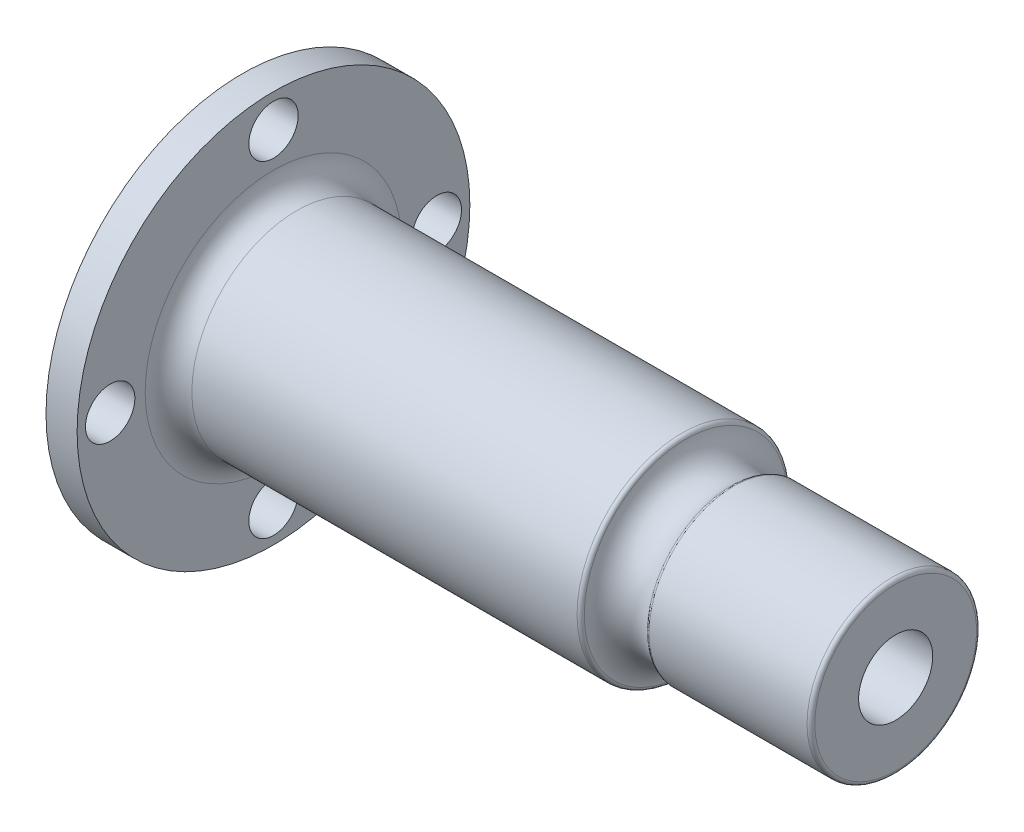
ISO-10303-21;
HEADER;
FILE_DESCRIPTION(('STEP AP214'),'2;1');
FILE_NAME('part.step','',(''),(''),'','','');
FILE_SCHEMA(('AUTOMOTIVE_DESIGN { 1 0 10303 214 1 1 1 1 }'));
ENDSEC;
DATA;
#1=APPLICATION_CONTEXT('core data for automotive mechanical design processes');
#2=APPLICATION_PROTOCOL_DEFINITION('international standard','automotive_design',2000,#1);
#3=PRODUCT_CONTEXT('',#1,'mechanical');
#4=PRODUCT('Part','Part','',(#3));
#5=PRODUCT_RELATED_PRODUCT_CATEGORY('part','',(#4));
#6=PRODUCT_DEFINITION_FORMATION('','',#4);
#7=PRODUCT_DEFINITION_CONTEXT('part definition',#1,'design');
#8=PRODUCT_DEFINITION('design','',#6,#7);
#9=PRODUCT_DEFINITION_SHAPE('','',#8);
#10=(LENGTH_UNIT() NAMED_UNIT(*) SI_UNIT(.MILLI.,.METRE.));
#11=(NAMED_UNIT(*) PLANE_ANGLE_UNIT() SI_UNIT($,.RADIAN.));
#12=(NAMED_UNIT(*) SI_UNIT($,.STERADIAN.) SOLID_ANGLE_UNIT());
#13=UNCERTAINTY_MEASURE_WITH_UNIT(LENGTH_MEASURE(1.E-05),#10,'distance_accuracy_value','');
#14=(GEOMETRIC_REPRESENTATION_CONTEXT(3) GLOBAL_UNCERTAINTY_ASSIGNED_CONTEXT((#13)) GLOBAL_UNIT_ASSIGNED_CONTEXT((#10,
#11,#12)) REPRESENTATION_CONTEXT('',''));
#15=CARTESIAN_POINT('',(0.,0.,0.));
#16=DIRECTION('',(0.,0.,1.));
#17=DIRECTION('',(1.,0.,0.));
#18=AXIS2_PLACEMENT_3D('',#15,#16,#17);
#19=CARTESIAN_POINT('',(54.5999999999995,13.5000000000002,1.38777878078145E-13));
#20=DIRECTION('',(-1.,0.,0.));
#21=DIRECTION('',(0.,0.,1.));
#22=AXIS2_PLACEMENT_3D('',#19,#20,#21);
#23=PLANE('',#22);
#24=CARTESIAN_POINT('',(54.5999999999995,-21.0000000000002,-1.30451205393456E-12));
#25=DIRECTION('',(-1.,0.,0.));
#26=DIRECTION('',(0.,0.,1.));
#27=AXIS2_PLACEMENT_3D('',#24,#25,#26);
#28=CIRCLE('',#27,3.17500000000128);
#29=CARTESIAN_POINT('',(54.5999999999995,-21.0000000000002,3.17499999999998));
#30=VERTEX_POINT('',#29);
#31=EDGE_CURVE('E177',#30,#30,#28,.F.);
#32=ORIENTED_EDGE('',*,*,#31,.F.);
#33=EDGE_LOOP('',(#32));
#34=FACE_BOUND('',#33,.T.);
#35=CARTESIAN_POINT('',(54.5999999999995,3.33066907387547E-13,-21.0000000000006));
#36=DIRECTION('',(-1.,0.,0.));
#37=DIRECTION('',(0.,0.,1.));
#38=AXIS2_PLACEMENT_3D('',#35,#36,#37);
#39=CIRCLE('',#38,3.17500000000047);
#40=CARTESIAN_POINT('',(54.5999999999995,3.31656924146273E-13,-17.8250000000002));
#41=VERTEX_POINT('',#40);
#42=EDGE_CURVE('E71',#41,#41,#39,.F.);
#43=ORIENTED_EDGE('',*,*,#42,.F.);
#44=EDGE_LOOP('',(#43));
#45=FACE_BOUND('',#44,.T.);
#46=CARTESIAN_POINT('',(54.5999999999998,-2.22044604925031E-13,0.));
#47=DIRECTION('',(-1.,0.,0.));
#48=DIRECTION('',(0.,0.,1.));
#49=AXIS2_PLACEMENT_3D('',#46,#47,#48);
#50=CIRCLE('',#49,16.5);
#51=CARTESIAN_POINT('',(54.5999999999998,-2.29372076887557E-13,16.5000000000001));
#52=VERTEX_POINT('',#51);
#53=EDGE_CURVE('E50',#52,#52,#50,.T.);
#54=ORIENTED_EDGE('',*,*,#53,.T.);
#55=EDGE_LOOP('',(#54));
#56=FACE_BOUND('',#55,.T.);
#57=CARTESIAN_POINT('',(54.5999999999998,-2.22044604925031E-13,0.));
#58=DIRECTION('',(-1.,0.,0.));
#59=DIRECTION('',(0.,0.,1.));
#60=AXIS2_PLACEMENT_3D('',#57,#58,#59);
#61=CIRCLE('',#60,25.25);
#62=CARTESIAN_POINT('',(54.5999999999998,-2.33257857473745E-13,25.2500000000001));
#63=VERTEX_POINT('',#62);
#64=EDGE_CURVE('E59',#63,#63,#61,.T.);
#65=ORIENTED_EDGE('',*,*,#64,.F.);
#66=EDGE_LOOP('',(#65));
#67=FACE_BOUND('',#66,.T.);
#68=CARTESIAN_POINT('',(54.5999999999995,21.,0.));
#69=DIRECTION('',(-1.,0.,0.));
#70=DIRECTION('',(0.,0.,1.));
#71=AXIS2_PLACEMENT_3D('',#68,#69,#70);
#72=CIRCLE('',#71,3.175);
#73=CARTESIAN_POINT('',(54.5999999999995,21.,3.17499999999996));
#74=VERTEX_POINT('',#73);
#75=EDGE_CURVE('E72',#74,#74,#72,.F.);
#76=ORIENTED_EDGE('',*,*,#75,.F.);
#77=EDGE_LOOP('',(#76));
#78=FACE_BOUND('',#77,.T.);
#79=CARTESIAN_POINT('',(54.6000000000002,-9.99200722162641E-13,20.9999999999994));
#80=DIRECTION('',(-1.,0.,0.));
#81=DIRECTION('',(0.,0.,1.));
#82=AXIS2_PLACEMENT_3D('',#79,#80,#81);
#83=CIRCLE('',#82,3.17500000000095);
#84=CARTESIAN_POINT('',(54.6000000000002,-1.00061070540392E-12,24.1750000000004));
#85=VERTEX_POINT('',#84);
#86=EDGE_CURVE('E181',#85,#85,#83,.F.);
#87=ORIENTED_EDGE('',*,*,#86,.F.);
#88=EDGE_LOOP('',(#87));
#89=FACE_BOUND('',#88,.T.);
#90=ADVANCED_FACE('F37',(#34,#45,#56,#67,#78,#89),#23,.F.);
#91=CARTESIAN_POINT('',(43.0851485148516,-4.44089209850063E-13,1.38777878078145E-13));
#92=DIRECTION('',(1.,0.,0.));
#93=DIRECTION('',(0.,0.,-1.));
#94=AXIS2_PLACEMENT_3D('',#91,#92,#93);
#95=CONICAL_SURFACE('',#94,8.,1.15994513549311);
#96=CARTESIAN_POINT('',(49.7656543388043,-23.2245749399343,-2.2653678148683));
#97=CARTESIAN_POINT('',(49.7132868239322,-23.0910039417577,-2.39651970513222));
#98=CARTESIAN_POINT('',(49.6562570449438,-22.9465767832423,-2.51506317578598));
#99=CARTESIAN_POINT('',(49.5345438672557,-22.6413248056925,-2.72416030299259));
#100=CARTESIAN_POINT('',(49.4698443412618,-22.4804655363798,-2.81465348107135));
#101=CARTESIAN_POINT('',(49.3347647398545,-22.1482429657563,-2.96569184746934));
#102=CARTESIAN_POINT('',(49.2644045474879,-21.9769168990074,-3.02633695585924));
#103=CARTESIAN_POINT('',(49.1195294787827,-21.6282433206149,-3.11743718212168));
#104=CARTESIAN_POINT('',(49.0450159822175,-21.4508978162613,-3.14790226373299));
#105=CARTESIAN_POINT('',(48.8894385753592,-21.0851626406207,-3.17943753753823));
#106=CARTESIAN_POINT('',(48.808237219161,-20.896688170984,-3.17885428188936));
#107=CARTESIAN_POINT('',(48.6450781806765,-20.5230577401005,-3.14457874222476));
#108=CARTESIAN_POINT('',(48.5631202330724,-20.3379030155998,-3.11087436983991));
#109=CARTESIAN_POINT('',(48.3977754750071,-19.9694259119053,-3.00937129219942));
#110=CARTESIAN_POINT('',(48.3144398375621,-19.7863971707155,-2.94041481366924));
#111=CARTESIAN_POINT('',(48.1520142125055,-19.4345555309157,-2.76917327301335));
#112=CARTESIAN_POINT('',(48.072924583895,-19.265743833676,-2.66688539786275));
#113=CARTESIAN_POINT('',(47.9235218697905,-18.9509523029699,-2.43302934228595));
#114=CARTESIAN_POINT('',(47.8530667321534,-18.8045886299866,-2.30207678750244));
#115=CARTESIAN_POINT('',(47.7552632066986,-18.6036532760828,-2.08516371171527));
#116=CARTESIAN_POINT('',(47.7239631827298,-18.5397524822966,-2.00940743344191));
#117=CARTESIAN_POINT('',(47.6644211441453,-18.4188288606008,-1.85149892979986));
#118=CARTESIAN_POINT('',(47.6361773643199,-18.361802060253,-1.76935044405753));
#119=CARTESIAN_POINT('',(47.5853810801288,-18.2597156870073,-1.60622298543487));
#120=CARTESIAN_POINT('',(47.5625515022665,-18.2140575078825,-1.52570399757321));
#121=CARTESIAN_POINT('',(47.5202045432026,-18.1296782620913,-1.36032700781497));
#122=CARTESIAN_POINT('',(47.5006853583875,-18.0909534172665,-1.27547140166355));
#123=CARTESIAN_POINT('',(47.4652849681862,-18.0209339635354,-1.10205458017123));
#124=CARTESIAN_POINT('',(47.4494019530298,-17.9896356580571,-1.01349523430301));
#125=CARTESIAN_POINT('',(47.4215546137079,-17.9348883481429,-0.833418798706617));
#126=CARTESIAN_POINT('',(47.4095898539978,-17.9114384712866,-0.741902038961416));
#127=CARTESIAN_POINT('',(47.382085868266,-17.8576088545977,-0.484122683348831));
#128=CARTESIAN_POINT('',(47.3710704356722,-17.836154620863,-0.315383876957203));
#129=CARTESIAN_POINT('',(47.3630657893119,-17.8205547800152,0.0235545540213407));
#130=CARTESIAN_POINT('',(47.3660709721932,-17.8263982633446,0.193753567894406));
#131=CARTESIAN_POINT('',(47.3852668290221,-17.8638526602665,0.520156654483197));
#132=CARTESIAN_POINT('',(47.4006596686708,-17.8939045297782,0.676589644057801));
#133=CARTESIAN_POINT('',(47.4427303697854,-17.9764713372809,0.981785461524499));
#134=CARTESIAN_POINT('',(47.4694089889671,-18.0289877835236,1.13054777366256));
#135=CARTESIAN_POINT('',(47.5334938755365,-18.1560347590003,1.42063902099703));
#136=CARTESIAN_POINT('',(47.5711615551353,-18.2311032435568,1.56167326679909));
#137=CARTESIAN_POINT('',(47.655169410089,-18.4000089061259,1.82912947974794));
#138=CARTESIAN_POINT('',(47.7015123372687,-18.4938520401866,1.95554678970183));
#139=CARTESIAN_POINT('',(47.8054437954769,-18.7064192886613,2.20201133667734));
#140=CARTESIAN_POINT('',(47.8636614476122,-18.8266018507851,2.32053382024481));
#141=CARTESIAN_POINT('',(47.9860778569756,-19.0823033949481,2.53595088953874));
#142=CARTESIAN_POINT('',(48.0502791209527,-19.2178288098077,2.63283635249441));
#143=CARTESIAN_POINT('',(48.1893447229636,-19.514997374556,2.81219303454492));
#144=CARTESIAN_POINT('',(48.2646335521793,-19.6778971320029,2.8922570304973));
#145=CARTESIAN_POINT('',(48.4178100864735,-20.013850695337,3.02335552665692));
#146=CARTESIAN_POINT('',(48.4956987428656,-20.1869082360656,3.07437927457101));
#147=CARTESIAN_POINT('',(48.6573097276308,-20.5507990634283,3.14890450269277));
#148=CARTESIAN_POINT('',(48.7410718896963,-20.7420448393239,3.17032269121466));
#149=CARTESIAN_POINT('',(48.9069727619869,-21.1260038825151,3.17830620509222));
#150=CARTESIAN_POINT('',(48.9891112081087,-21.3187173815937,3.16486590682535));
#151=CARTESIAN_POINT('',(49.1504745429829,-21.7021098404763,3.10254310810231));
#152=CARTESIAN_POINT('',(49.2296592351936,-21.8927454707262,3.05328579805663));
#153=CARTESIAN_POINT('',(49.3820022197921,-22.2637442059926,2.91932270102298));
#154=CARTESIAN_POINT('',(49.4551615912651,-22.4441091486112,2.83462327801926));
#155=CARTESIAN_POINT('',(49.5903627483608,-22.7807699282867,2.63554367455254));
#156=CARTESIAN_POINT('',(49.6527447029991,-22.937762589415,2.52257652833133));
#157=CARTESIAN_POINT('',(49.7681239642305,-23.2304568995811,2.26787713858251));
#158=CARTESIAN_POINT('',(49.8211254878949,-23.3661681127742,2.12615788268518));
#159=CARTESIAN_POINT('',(49.9125970727456,-23.6018411792385,1.82878538249345));
#160=CARTESIAN_POINT('',(49.9518321433682,-23.7036581900974,1.67483807818983));
#161=CARTESIAN_POINT('',(50.0194055822717,-23.8797434868103,1.3497487954954));
#162=CARTESIAN_POINT('',(50.0477490063003,-23.9540245538913,1.1786148415485));
#163=CARTESIAN_POINT('',(50.0910284630923,-24.0677222365502,0.836632754469789));
#164=CARTESIAN_POINT('',(50.1067444735226,-24.1091644355148,0.666554909900648));
#165=CARTESIAN_POINT('',(50.1273464479991,-24.1635288824121,0.321280378398514));
#166=CARTESIAN_POINT('',(50.1322360006341,-24.1764605805639,0.146085407127175));
#167=CARTESIAN_POINT('',(50.1310545515307,-24.1733391479366,-0.196983969213794));
#168=CARTESIAN_POINT('',(50.1254129630454,-24.1584215842309,-0.364871633759527));
#169=CARTESIAN_POINT('',(50.1041785188764,-24.1023997353117,-0.695607692969382));
#170=CARTESIAN_POINT('',(50.0885833875716,-24.0612894618145,-0.858454926339915));
#171=CARTESIAN_POINT('',(50.0479196119823,-23.9544830392759,-1.17451856232095));
#172=CARTESIAN_POINT('',(50.0228536580787,-23.8887938724237,-1.3277376855903));
#173=CARTESIAN_POINT('',(49.9639731071274,-23.7352458462273,-1.62059698684357));
#174=CARTESIAN_POINT('',(49.9301691398169,-23.6474139265853,-1.76025338178828));
#175=CARTESIAN_POINT('',(49.8732737771231,-23.5004830353357,-1.95835528430707));
#176=CARTESIAN_POINT('',(49.8530692005323,-23.4484436233123,-2.0230138055953));
#177=CARTESIAN_POINT('',(49.8107609251313,-23.3398257045486,-2.14771476910424));
#178=CARTESIAN_POINT('',(49.7886574276274,-23.2832476789931,-2.20775769935256));
#179=CARTESIAN_POINT('',(49.7656543388043,-23.2245749399343,-2.2653678148683));
#180=B_SPLINE_CURVE_WITH_KNOTS('',3,(#96,#97,#98,#99,#100,#101,#102,#103,#104,#105,#106,#107,
#108,#109,#110,#111,#112,#113,#114,#115,#116,#117,#118,#119,#120,#121,#122,#123,#124,#125,#126,
#127,#128,#129,#130,#131,#132,#133,#134,#135,#136,#137,#138,#139,#140,#141,#142,#143,#144,#145,
#146,#147,#148,#149,#150,#151,#152,#153,#154,#155,#156,#157,#158,#159,#160,#161,#162,#163,#164,
#165,#166,#167,#168,#169,#170,#171,#172,#173,#174,#175,#176,#177,#178,#179),.UNSPECIFIED.,.T.,
.F.,(4,2,2,2,2,2,2,2,2,2,2,2,2,2,2,2,2,2,2,2,2,2,2,2,2,2,2,2,2,2,2,2,2,2,2,2,2,2,2,2,2,4),(0.,
0.582812467227126,1.16687291781942,1.74896462547257,2.33086409524148,2.94378152154864,
3.55692273031369,4.19163517971926,4.82640120997384,5.44867937309624,5.76009284999615,
6.07132549130354,6.35694821173589,6.64241481186573,6.92773902105781,7.21303150346497,
7.72146582759417,8.22969697287253,8.7075886047151,9.18551232681305,9.67588909186943,
10.166421670868,10.6998670618904,11.2335369454979,11.8205255432419,12.4077313352217,
13.0344550818411,13.6612799423449,14.294760421582,14.9281272018692,15.5345997035514,
16.1407988627439,16.703918377843,17.2667761841978,17.7913988312298,18.3158475583161,
18.8193771641034,19.3230219302043,19.8265237331336,20.3294158885059,20.5854506959361,
20.841458394288),.UNSPECIFIED.);
#181=CARTESIAN_POINT('',(49.7656543388043,-23.2245749399343,-2.2653678148683));
#182=VERTEX_POINT('',#181);
#183=EDGE_CURVE('E180',#182,#182,#180,.T.);
#184=ORIENTED_EDGE('',*,*,#183,.T.);
#185=EDGE_LOOP('',(#184));
#186=FACE_BOUND('',#185,.T.);
#187=CARTESIAN_POINT('',(49.7656543388052,-2.26536781486608,-23.2245749399339));
#188=CARTESIAN_POINT('',(49.8131090064027,-2.14650064352539,-23.3456156487838));
#189=CARTESIAN_POINT('',(49.8568039434094,-2.01712003021576,-23.4579158499019));
#190=CARTESIAN_POINT('',(49.935503202155,-1.74012355214171,-23.6612267221608));
#191=CARTESIAN_POINT('',(49.9705034030418,-1.59249909018831,-23.7522272972117));
#192=CARTESIAN_POINT('',(50.030837862143,-1.28245185141723,-23.9096767243973));
#193=CARTESIAN_POINT('',(50.0561532164281,-1.12000089204495,-23.9760775521867));
#194=CARTESIAN_POINT('',(50.0962128178245,-0.785189755270953,-24.0813764183063));
#195=CARTESIAN_POINT('',(50.1109597449096,-0.612832102022387,-24.1202814290742));
#196=CARTESIAN_POINT('',(50.129073854644,-0.269692747264765,-24.1680958292623));
#197=CARTESIAN_POINT('',(50.1328267307554,-0.0990726201662459,-24.1780218169082));
#198=CARTESIAN_POINT('',(50.1299354955042,0.241448873479098,-24.1703818410567));
#199=CARTESIAN_POINT('',(50.1232926518637,0.411350325132562,-24.1528192296986));
#200=CARTESIAN_POINT('',(50.100040594404,0.742368147962944,-24.0914936332751));
#201=CARTESIAN_POINT('',(50.0836172215779,0.903588694994377,-24.0482192352757));
#202=CARTESIAN_POINT('',(50.0414466354625,1.21619412573754,-23.9375155394649));
#203=CARTESIAN_POINT('',(50.0156990070748,1.36757857121039,-23.8700851662758));
#204=CARTESIAN_POINT('',(49.9549901207202,1.65964760323631,-23.7118869471512));
#205=CARTESIAN_POINT('',(49.9198540182209,1.80005585326233,-23.6206771271991));
#206=CARTESIAN_POINT('',(49.8415631450506,2.06348368809359,-23.4187238510361));
#207=CARTESIAN_POINT('',(49.7984067951542,2.18649983989645,-23.3079765480184));
#208=CARTESIAN_POINT('',(49.7027231302881,2.4185157398059,-23.0642542410418));
#209=CARTESIAN_POINT('',(49.6498281164592,2.52646977835131,-22.9304292163987));
#210=CARTESIAN_POINT('',(49.5376210437677,2.7184998526028,-22.6490670588577));
#211=CARTESIAN_POINT('',(49.4783071482487,2.80256902897337,-22.5015260030564));
#212=CARTESIAN_POINT('',(49.3503513200638,2.95050499883802,-22.1863671247792));
#213=CARTESIAN_POINT('',(49.281349180983,3.01260506931777,-22.0180663131484));
#214=CARTESIAN_POINT('',(49.1391228159335,3.10749617483234,-21.6751143560643));
#215=CARTESIAN_POINT('',(49.0658972550709,3.14027788859584,-21.5004612093476));
#216=CARTESIAN_POINT('',(48.9119980275175,3.17757224105816,-21.1378173098295));
#217=CARTESIAN_POINT('',(48.8311493965243,3.18011228268851,-20.9496965462195));
#218=CARTESIAN_POINT('',(48.6685108509017,3.15217265365362,-20.5763124211268));
#219=CARTESIAN_POINT('',(48.5867206809275,3.12168380639222,-20.3910498682644));
#220=CARTESIAN_POINT('',(48.4213468537295,3.02670075934084,-20.0215265659494));
#221=CARTESIAN_POINT('',(48.3378084017329,2.96099313680585,-19.8375551026953));
#222=CARTESIAN_POINT('',(48.1747018604258,2.79614685709504,-19.4832959469048));
#223=CARTESIAN_POINT('',(48.0951342009762,2.69700458940268,-19.3130097346617));
#224=CARTESIAN_POINT('',(47.9442353528268,2.46886216594759,-18.9942495137512));
#225=CARTESIAN_POINT('',(47.8727890675993,2.34038673078858,-18.8454594892672));
#226=CARTESIAN_POINT('',(47.7732880546115,2.12685292026664,-18.6405724077839));
#227=CARTESIAN_POINT('',(47.7413863302246,2.05216608020453,-18.5753008016506));
#228=CARTESIAN_POINT('',(47.6805713219282,1.89626978435965,-18.4515357941468));
#229=CARTESIAN_POINT('',(47.6516563261009,1.81506411298069,-18.3930385075509));
#230=CARTESIAN_POINT('',(47.5994382287379,1.65338797707884,-18.2879011105777));
#231=CARTESIAN_POINT('',(47.5758715335664,1.57337469746518,-18.2406875725874));
#232=CARTESIAN_POINT('',(47.5320183554242,1.4088482554447,-18.1531688096482));
#233=CARTESIAN_POINT('',(47.5117300889334,1.32433757319248,-18.1128598277841));
#234=CARTESIAN_POINT('',(47.474769896538,1.15144026414308,-18.0396600216787));
#235=CARTESIAN_POINT('',(47.458096155209,1.06305561002216,-18.006765473147));
#236=CARTESIAN_POINT('',(47.428658874923,0.883151462482185,-17.9488339753208));
#237=CARTESIAN_POINT('',(47.4158948907695,0.791632327300932,-17.9237961313904));
#238=CARTESIAN_POINT('',(47.3861841314093,0.533671005379914,-17.8656068014557));
#239=CARTESIAN_POINT('',(47.3737609509049,0.364557843803981,-17.8414001560515));
#240=CARTESIAN_POINT('',(47.36304824126,0.0243245367819597,-17.8205188667806));
#241=CARTESIAN_POINT('',(47.3647526518751,-0.146794716667068,-17.8238324177097));
#242=CARTESIAN_POINT('',(47.3815801843668,-0.474800998404434,-17.856655420661));
#243=CARTESIAN_POINT('',(47.395846129637,-0.631902755834756,-17.8844915547083));
#244=CARTESIAN_POINT('',(47.4357942678068,-0.938796069218159,-17.9628338071871));
#245=CARTESIAN_POINT('',(47.4614770397051,-1.08858725399163,-18.0133410753748));
#246=CARTESIAN_POINT('',(47.523590021058,-1.38047986746198,-18.1363409919505));
#247=CARTESIAN_POINT('',(47.5602459131584,-1.52233713796337,-18.2092963039183));
#248=CARTESIAN_POINT('',(47.6423503470224,-1.79175935050629,-18.3741305654306));
#249=CARTESIAN_POINT('',(47.6878016123737,-1.91931984601584,-18.4660153772819));
#250=CARTESIAN_POINT('',(47.7899179129914,-2.16822997166063,-18.6744977014759));
#251=CARTESIAN_POINT('',(47.8472098933581,-2.28811258186622,-18.7925375681776));
#252=CARTESIAN_POINT('',(47.967914391128,-2.50659697306376,-19.0441392028841));
#253=CARTESIAN_POINT('',(48.0313294805208,-2.60518975457032,-19.1777074983981));
#254=CARTESIAN_POINT('',(48.1689315804877,-2.78851745219439,-19.4710698245208));
#255=CARTESIAN_POINT('',(48.2435607377947,-2.870865154299,-19.6321504923653));
#256=CARTESIAN_POINT('',(48.3955961466111,-3.00686710135785,-19.9647757368748));
#257=CARTESIAN_POINT('',(48.4730033322315,-3.06051159656011,-20.1363238470498));
#258=CARTESIAN_POINT('',(48.6339810663154,-3.14087445075096,-20.4978564246838));
#259=CARTESIAN_POINT('',(48.7176061021436,-3.16546254918651,-20.6882936336685));
#260=CARTESIAN_POINT('',(48.8834671532225,-3.17998057625212,-21.071182878596));
#261=CARTESIAN_POINT('',(48.965702582461,-3.16989623246441,-21.2636357117367));
#262=CARTESIAN_POINT('',(49.1277380021873,-3.11437055382043,-21.647681062734));
#263=CARTESIAN_POINT('',(49.2074882122534,-3.06843941463676,-21.8392243869399));
#264=CARTESIAN_POINT('',(49.361081179566,-2.94098428301677,-22.2124400708859));
#265=CARTESIAN_POINT('',(49.4349317121023,-2.8595080831747,-22.3941253178957));
#266=CARTESIAN_POINT('',(49.5524157173794,-2.69375471038081,-22.6860923325043));
#267=CARTESIAN_POINT('',(49.5982036861729,-2.61856321910055,-22.8007433394923));
#268=CARTESIAN_POINT('',(49.6853863647254,-2.45305372085488,-23.020408531122));
#269=CARTESIAN_POINT('',(49.7267817597341,-2.36273807896936,-23.1254242185445));
#270=CARTESIAN_POINT('',(49.7656543388052,-2.26536781486608,-23.2245749399339));
#271=B_SPLINE_CURVE_WITH_KNOTS('',3,(#187,#188,#189,#190,#191,#192,#193,#194,#195,#196,#197,
#198,#199,#200,#201,#202,#203,#204,#205,#206,#207,#208,#209,#210,#211,#212,#213,#214,#215,#216,
#217,#218,#219,#220,#221,#222,#223,#224,#225,#226,#227,#228,#229,#230,#231,#232,#233,#234,#235,
#236,#237,#238,#239,#240,#241,#242,#243,#244,#245,#246,#247,#248,#249,#250,#251,#252,#253,#254,
#255,#256,#257,#258,#259,#260,#261,#262,#263,#264,#265,#266,#267,#268,#269,#270),.UNSPECIFIED.,
.T.,.F.,(4,2,2,2,2,2,2,2,2,2,2,2,2,2,2,2,2,2,2,2,2,2,2,2,2,2,2,2,2,2,2,2,2,2,2,2,2,2,2,2,2,4),
(0.,0.527997371553111,1.05624451096853,1.58551754245094,2.11465631174231,2.62499542681762,
3.13527231265566,3.63614957036098,4.1370491289322,4.64802000719318,5.15909160489778,
5.69643731719329,6.23393719062095,6.8080588155936,7.38236290792019,7.99393681413056,
8.60568068084004,9.24000057698888,9.87438899356659,10.4982128858706,10.8104095431168,
11.1224262523658,11.4095763757966,11.6965697549865,11.9834186537538,12.2702348774333,
12.7811423355361,13.2918306434866,13.7701570687709,14.2485077549049,14.7374652314376,
15.2265743622327,15.7575632334651,16.2887761230536,16.8733551903563,17.4581326984997,
18.0835484636424,18.7092217031074,19.3435969832029,19.977121921619,20.4096995312852,
20.8422095585207),.UNSPECIFIED.);
#272=CARTESIAN_POINT('',(49.7656543388052,-2.26536781486608,-23.2245749399339));
#273=VERTEX_POINT('',#272);
#274=EDGE_CURVE('E64',#273,#273,#271,.T.);
#275=ORIENTED_EDGE('',*,*,#274,.T.);
#276=EDGE_LOOP('',(#275));
#277=FACE_BOUND('',#276,.T.);
#278=CARTESIAN_POINT('',(50.6,-3.88578058618805E-13,0.));
#279=DIRECTION('',(-1.,0.,0.));
#280=DIRECTION('',(0.,0.,1.));
#281=AXIS2_PLACEMENT_3D('',#278,#279,#280);
#282=CIRCLE('',#281,25.25);
#283=CARTESIAN_POINT('',(50.6,-3.99791311167519E-13,25.25));
#284=VERTEX_POINT('',#283);
#285=EDGE_CURVE('E164',#284,#284,#282,.T.);
#286=ORIENTED_EDGE('',*,*,#285,.T.);
#287=EDGE_LOOP('',(#286));
#288=FACE_BOUND('',#287,.T.);
#289=CARTESIAN_POINT('',(43.0851485148516,-4.44089209850063E-13,1.38777878078145E-13));
#290=DIRECTION('',(-1.,0.,0.));
#291=DIRECTION('',(0.,0.,1.));
#292=AXIS2_PLACEMENT_3D('',#289,#290,#291);
#293=CIRCLE('',#292,8.);
#294=CARTESIAN_POINT('',(43.0851485148516,-4.47641923528863E-13,8.00000000000015));
#295=VERTEX_POINT('',#294);
#296=EDGE_CURVE('E63',#295,#295,#293,.T.);
#297=ORIENTED_EDGE('',*,*,#296,.F.);
#298=EDGE_LOOP('',(#297));
#299=FACE_BOUND('',#298,.T.);
#300=CARTESIAN_POINT('',(47.8238659812642,18.7447545904964,-2.23483748834798));
#301=CARTESIAN_POINT('',(47.8893001815065,18.8797767883707,-2.37108225606689));
#302=CARTESIAN_POINT('',(47.9594711010155,19.0262048425172,-2.49408613693269));
#303=CARTESIAN_POINT('',(48.1061988456842,19.3366596977608,-2.71107920209641));
#304=CARTESIAN_POINT('',(48.1827706522582,19.500728058412,-2.80499775173992));
#305=CARTESIAN_POINT('',(48.3392864561704,19.8408638967908,-2.96174892102481));
#306=CARTESIAN_POINT('',(48.419219062519,20.0168919195615,-3.02467859909215));
#307=CARTESIAN_POINT('',(48.5802951286452,20.3765804975569,-3.11873813105096));
#308=CARTESIAN_POINT('',(48.6614380239439,20.5602375617971,-3.14988236645002));
#309=CARTESIAN_POINT('',(48.826367689091,20.9385640202587,-3.18031218298327));
#310=CARTESIAN_POINT('',(48.9101176142232,21.1333668119546,-3.17816629540682));
#311=CARTESIAN_POINT('',(49.07446967776,21.5206808196784,-3.13806056054948));
#312=CARTESIAN_POINT('',(49.1550712258367,21.7131916012896,-3.10009403006634));
#313=CARTESIAN_POINT('',(49.3102283917251,22.0882081604987,-2.98903252625849));
#314=CARTESIAN_POINT('',(49.3848324983698,22.2707892482936,-2.91626150448925));
#315=CARTESIAN_POINT('',(49.5266913026511,22.6215927121648,-2.73675774335131));
#316=CARTESIAN_POINT('',(49.5939482576345,22.7898194949761,-2.63003547484771));
#317=CARTESIAN_POINT('',(49.7155510095594,23.0966543283229,-2.39171158437693));
#318=CARTESIAN_POINT('',(49.7704068712652,23.2363893715333,-2.261823982347));
#319=CARTESIAN_POINT('',(49.8700030693479,23.4917879431486,-1.97690688081218));
#320=CARTESIAN_POINT('',(49.9147483626375,23.607463265102,-1.82188976586766));
#321=CARTESIAN_POINT('',(49.9897245005436,23.8022379141033,-1.50344217903229));
#322=CARTESIAN_POINT('',(50.0207803372776,23.8834004364937,-1.34146715825175));
#323=CARTESIAN_POINT('',(50.0718789975789,24.0173333231728,-1.00455951047513));
#324=CARTESIAN_POINT('',(50.0919264041189,24.0701155024282,-0.829632310136094));
#325=CARTESIAN_POINT('',(50.1194576364075,24.1426904493666,-0.483250561834289));
#326=CARTESIAN_POINT('',(50.127628332135,24.1642862789767,-0.312226460776903));
#327=CARTESIAN_POINT('',(50.1333838519572,24.17949320787,0.0312249849457146));
#328=CARTESIAN_POINT('',(50.1309708491847,24.1731100520304,0.203652034289181));
#329=CARTESIAN_POINT('',(50.1158490449035,24.1331830461308,0.54011410795233));
#330=CARTESIAN_POINT('',(50.1034195372869,24.1003759963539,0.704250057126283));
#331=CARTESIAN_POINT('',(50.0689936711982,24.0097987820107,1.02440959067189));
#332=CARTESIAN_POINT('',(50.0469972146043,23.9520283614118,1.1804330918212));
#333=CARTESIAN_POINT('',(49.9937365973674,23.8127730902365,1.48219127702221));
#334=CARTESIAN_POINT('',(49.9623605124686,23.7310020751338,1.62777376115851));
#335=CARTESIAN_POINT('',(49.8913036397115,23.5468868684913,1.90300353345606));
#336=CARTESIAN_POINT('',(49.8516214273833,23.4445391482425,2.03264808225958));
#337=CARTESIAN_POINT('',(49.7629461662851,23.2174109479389,2.27882238452617));
#338=CARTESIAN_POINT('',(49.7136088844998,23.0918153538573,2.3944749625884));
#339=CARTESIAN_POINT('',(49.6081527484911,22.8256045578216,2.60315660131149));
#340=CARTESIAN_POINT('',(49.5520320476395,22.6849852672301,2.69617948070604));
#341=CARTESIAN_POINT('',(49.4303652517207,22.3829746577489,2.86351861689322));
#342=CARTESIAN_POINT('',(49.3644412223353,22.220824573967,2.93619008876876));
#343=CARTESIAN_POINT('',(49.2278507288792,21.8885182637104,3.05323165379557));
#344=CARTESIAN_POINT('',(49.1571827692853,21.7183595176067,3.09759277536638));
#345=CARTESIAN_POINT('',(49.0077666535753,21.3627724614898,3.15970621780728));
#346=CARTESIAN_POINT('',(48.9287949759241,21.177088270586,3.17546232075692));
#347=CARTESIAN_POINT('',(48.7691194087998,20.8065349707106,3.17451656248056));
#348=CARTESIAN_POINT('',(48.6884150190703,20.6216661162237,3.15780519938396));
#349=CARTESIAN_POINT('',(48.5236656950164,20.2493091309891,3.09102430328034));
#350=CARTESIAN_POINT('',(48.439633220382,20.0620751944702,3.03949272597292));
#351=CARTESIAN_POINT('',(48.2743894982023,19.698996339877,2.90270378193779));
#352=CARTESIAN_POINT('',(48.1931787204474,19.5231533141268,2.81744082819442));
#353=CARTESIAN_POINT('',(48.0366760242005,19.1887980003628,2.61498377282849));
#354=CARTESIAN_POINT('',(47.9613620928889,19.0302203003212,2.4979165145077));
#355=CARTESIAN_POINT('',(47.8551175006777,18.8092053952636,2.30018735208902));
#356=CARTESIAN_POINT('',(47.8208077739993,18.7383102463972,2.23054806496343));
#357=CARTESIAN_POINT('',(47.7548590620381,18.6028259851534,2.08425070284813));
#358=CARTESIAN_POINT('',(47.7232186065118,18.5382333981924,2.0075965408287));
#359=CARTESIAN_POINT('',(47.6651026815574,18.4202196783226,1.8531482445865));
#360=CARTESIAN_POINT('',(47.6384226007762,18.3663383968952,1.77578208196039));
#361=CARTESIAN_POINT('',(47.5881750591807,18.2653099691587,1.61586954194416));
#362=CARTESIAN_POINT('',(47.5646059292001,18.2181592105033,1.533325977827));
#363=CARTESIAN_POINT('',(47.520954654693,18.1311652976925,1.36363216758121));
#364=CARTESIAN_POINT('',(47.5008708328393,18.0913186278745,1.27648416385829));
#365=CARTESIAN_POINT('',(47.4645372980804,18.0194567935972,1.0982861112947));
#366=CARTESIAN_POINT('',(47.4482871167436,17.9874406723079,1.00723654079358));
#367=CARTESIAN_POINT('',(47.4088463765682,17.9099105583197,0.749416107370185));
#368=CARTESIAN_POINT('',(47.3901628356309,17.8734139516202,0.579099426608733));
#369=CARTESIAN_POINT('',(47.3673338168506,17.8288553145948,0.23397350380328));
#370=CARTESIAN_POINT('',(47.3631793521895,17.8207757071943,0.0591671062659827));
#371=CARTESIAN_POINT('',(47.3693974526022,17.8328947086084,-0.275463154047332));
#372=CARTESIAN_POINT('',(47.3786598486626,17.8509322245624,-0.435390058846768));
#373=CARTESIAN_POINT('',(47.4091795521889,17.9106167477196,-0.749611534756852));
#374=CARTESIAN_POINT('',(47.4304400378872,17.9522700106263,-0.903904601957972));
#375=CARTESIAN_POINT('',(47.483898118083,18.057660273098,-1.2035976442482));
#376=CARTESIAN_POINT('',(47.5161522496478,18.1215114646338,-1.34894696896929));
#377=CARTESIAN_POINT('',(47.5899588977516,18.268795236526,-1.62659350921269));
#378=CARTESIAN_POINT('',(47.6315020935212,18.3522081924181,-1.75890361804274));
#379=CARTESIAN_POINT('',(47.6995507673243,18.4901121735376,-1.94605854858177));
#380=CARTESIAN_POINT('',(47.723249068537,18.5383337990245,-2.00668191074506));
#381=CARTESIAN_POINT('',(47.7723350261039,18.6386819437388,-2.12385350901266));
#382=CARTESIAN_POINT('',(47.797722438279,18.6908078986899,-2.18040233168418));
#383=CARTESIAN_POINT('',(47.8238659812642,18.7447545904964,-2.23483748834798));
#384=B_SPLINE_CURVE_WITH_KNOTS('',3,(#300,#301,#302,#303,#304,#305,#306,#307,#308,#309,#310,
#311,#312,#313,#314,#315,#316,#317,#318,#319,#320,#321,#322,#323,#324,#325,#326,#327,#328,#329,
#330,#331,#332,#333,#334,#335,#336,#337,#338,#339,#340,#341,#342,#343,#344,#345,#346,#347,#348,
#349,#350,#351,#352,#353,#354,#355,#356,#357,#358,#359,#360,#361,#362,#363,#364,#365,#366,#367,
#368,#369,#370,#371,#372,#373,#374,#375,#376,#377,#378,#379,#380,#381,#382,#383),.UNSPECIFIED.,
.T.,.F.,(4,2,2,2,2,2,2,2,2,2,2,2,2,2,2,2,2,2,2,2,2,2,2,2,2,2,2,2,2,2,2,2,2,2,2,2,2,2,2,2,2,4),
(0.,0.607697233517729,1.21685891098312,1.82410033774145,2.43106689263205,3.06420261220487,
3.69745648183436,4.32492761048004,4.95220540877463,5.54459271955684,6.13668896714084,
6.68527319721517,7.23362887006116,7.74880081031213,8.26386697614408,8.76504867303852,
9.2662355103403,9.77365929866654,10.2811701796817,10.8120177841098,11.3430102263194,
11.9091327874435,12.4754346644453,13.0799272312278,13.6845967343739,14.316377041728,
14.948262036339,15.5776630055336,15.892687714973,16.2075377591756,16.5010870223551,
16.7944781371733,17.0877276616682,17.3809413355049,17.903400756044,18.4255369572033,
18.9068586309171,19.3883078641549,19.872271371015,20.3557514245209,20.5985854583647,
20.8413844638939),.UNSPECIFIED.);
#385=CARTESIAN_POINT('',(47.8238659812642,18.7447545904964,-2.23483748834798));
#386=VERTEX_POINT('',#385);
#387=EDGE_CURVE('E73',#386,#386,#384,.T.);
#388=ORIENTED_EDGE('',*,*,#387,.T.);
#389=EDGE_LOOP('',(#388));
#390=FACE_BOUND('',#389,.T.);
#391=CARTESIAN_POINT('',(47.8238659812646,-2.23483748834946,18.7447545904957));
#392=CARTESIAN_POINT('',(47.7667895719262,-2.11598467286963,18.6269801416909));
#393=CARTESIAN_POINT('',(47.7132422150005,-1.98691396757903,18.5177256489472));
#394=CARTESIAN_POINT('',(47.6154333208014,-1.71058824149063,18.3198158853773));
#395=CARTESIAN_POINT('',(47.5711737129144,-1.56332945247251,18.2311648941996));
#396=CARTESIAN_POINT('',(47.4940616479986,-1.25327158740701,18.0776789035777));
#397=CARTESIAN_POINT('',(47.4612553160196,-1.0904129649438,18.0129401450504));
#398=CARTESIAN_POINT('',(47.4093530686541,-0.754247840316152,17.9108993439297));
#399=CARTESIAN_POINT('',(47.3902500534609,-0.580946798986406,17.8735830932529));
#400=CARTESIAN_POINT('',(47.3678504762963,-0.241286847879735,17.8298647864532));
#401=CARTESIAN_POINT('',(47.3635861319518,-0.0752340422024369,17.8215697446005));
#402=CARTESIAN_POINT('',(47.3684264089622,0.255912617316729,17.8310012279594));
#403=CARTESIAN_POINT('',(47.3775283416744,0.421006657309524,17.8487225199544));
#404=CARTESIAN_POINT('',(47.4079053145887,0.738971772568723,17.9081221420054));
#405=CARTESIAN_POINT('',(47.4286984260854,0.8920687299225,17.9488523057304));
#406=CARTESIAN_POINT('',(47.4809367765676,1.18889747364049,18.0518077586616));
#407=CARTESIAN_POINT('',(47.5123834531678,1.33262799295487,18.1140359488795));
#408=CARTESIAN_POINT('',(47.5860025288257,1.6136812172783,18.2608587972504));
#409=CARTESIAN_POINT('',(47.6285865924702,1.75044224571432,18.34631840843));
#410=CARTESIAN_POINT('',(47.7218347224798,2.00777489155036,18.5352537111147));
#411=CARTESIAN_POINT('',(47.7725016562541,2.12834073562266,18.6387357973165));
#412=CARTESIAN_POINT('',(47.8851904039534,2.36201020832784,18.8713343732418));
#413=CARTESIAN_POINT('',(47.947833511385,2.47331946618809,19.001951684031));
#414=CARTESIAN_POINT('',(48.0783934730309,2.67259348834232,19.2775537400721));
#415=CARTESIAN_POINT('',(48.1463125448968,2.76054836668531,19.4225445340939));
#416=CARTESIAN_POINT('',(48.2921348205336,2.91915618798063,19.7377876343415));
#417=CARTESIAN_POINT('',(48.3703711136097,2.98734378159364,19.9091292754127));
#418=CARTESIAN_POINT('',(48.5285271912483,3.09307620082712,20.2602989961818));
#419=CARTESIAN_POINT('',(48.6084475331518,3.13061071298861,20.44012991065));
#420=CARTESIAN_POINT('',(48.7723278819263,3.17542016679094,20.8138304801388));
#421=CARTESIAN_POINT('',(48.856267022385,3.18090800111973,21.0079267135013));
#422=CARTESIAN_POINT('',(49.0214745742204,3.15629296298832,21.3950421949344));
#423=CARTESIAN_POINT('',(49.102742745794,3.12618690378304,21.5880613450183));
#424=CARTESIAN_POINT('',(49.2602081348827,3.03055313651474,21.9666259100677));
#425=CARTESIAN_POINT('',(49.3364197336946,2.96513118671377,22.1521918710232));
#426=CARTESIAN_POINT('',(49.4818991894992,2.79975522330881,22.5102477425625));
#427=CARTESIAN_POINT('',(49.551168829633,2.69981010695451,22.6827410082651));
#428=CARTESIAN_POINT('',(49.677297316429,2.47340467103652,22.9997113198267));
#429=CARTESIAN_POINT('',(49.7346131293407,2.34858569329836,23.1451766762991));
#430=CARTESIAN_POINT('',(49.8393371720809,2.07259930490609,23.4128517636825));
#431=CARTESIAN_POINT('',(49.8867501611043,1.92144461528489,23.5350726631018));
#432=CARTESIAN_POINT('',(49.967003351697,1.60901559757351,23.7430472976042));
#433=CARTESIAN_POINT('',(50.0006556639474,1.44928955529285,23.8308141597177));
#434=CARTESIAN_POINT('',(50.0569657809683,1.11553576485876,23.9781591672447));
#435=CARTESIAN_POINT('',(50.0796283782548,0.941514289602656,24.0377495998624));
#436=CARTESIAN_POINT('',(50.112113836588,0.596028610397317,24.1233049941163));
#437=CARTESIAN_POINT('',(50.1226574054342,0.425097395703308,24.1511564296114));
#438=CARTESIAN_POINT('',(50.1330731179238,0.0806723918209965,24.1786695499191));
#439=CARTESIAN_POINT('',(50.1329477076153,-0.0928208008696172,24.1783376962388));
#440=CARTESIAN_POINT('',(50.1222053634059,-0.431716407264667,24.1499629245716));
#441=CARTESIAN_POINT('',(50.1119152275016,-0.597202539213299,24.1227831725898));
#442=CARTESIAN_POINT('',(50.0816431793993,-0.921001540395399,24.0430546758071));
#443=CARTESIAN_POINT('',(50.0616613799175,-1.07931449303117,23.9905062260501));
#444=CARTESIAN_POINT('',(50.012382654917,-1.38584867699343,23.86145690597));
#445=CARTESIAN_POINT('',(49.9830099409854,-1.53397545401895,23.7847612375057));
#446=CARTESIAN_POINT('',(49.915812775941,-1.81508087087893,23.6102662635642));
#447=CARTESIAN_POINT('',(49.8779869943859,-1.94805712116687,23.5124636361105));
#448=CARTESIAN_POINT('',(49.7930552845354,-2.20132078664556,23.2943244701936));
#449=CARTESIAN_POINT('',(49.7456209912289,-2.32081967225999,23.1732015480833));
#450=CARTESIAN_POINT('',(49.6437865798363,-2.53787427512164,22.9152692098017));
#451=CARTESIAN_POINT('',(49.5893845927362,-2.63542408532353,22.7784555857903));
#452=CARTESIAN_POINT('',(49.4711279345374,-2.8125669353125,22.4837536674475));
#453=CARTESIAN_POINT('',(49.4068891486311,-2.89058654417712,22.3250741966935));
#454=CARTESIAN_POINT('',(49.2734126651417,-3.01887893326009,21.9988702487629));
#455=CARTESIAN_POINT('',(49.2041735757759,-3.0691439543549,21.8313433124995));
#456=CARTESIAN_POINT('',(49.0573475016307,-3.14395884902022,21.4801416380121));
#457=CARTESIAN_POINT('',(48.9795133312594,-3.16651839869008,21.2961453959996));
#458=CARTESIAN_POINT('',(48.8217036365356,-3.17952871476707,20.9278770521738));
#459=CARTESIAN_POINT('',(48.7417270652628,-3.16996348806312,20.7436048586219));
#460=CARTESIAN_POINT('',(48.5776766489661,-3.11795889188229,20.3706111851727));
#461=CARTESIAN_POINT('',(48.4935938743307,-3.07393325343927,20.182113447322));
#462=CARTESIAN_POINT('',(48.3277161775392,-2.95206083154552,19.815414245766));
#463=CARTESIAN_POINT('',(48.2459196165772,-2.8742389720372,19.6372053038256));
#464=CARTESIAN_POINT('',(48.1055917288259,-2.70791155944327,19.3355712820922));
#465=CARTESIAN_POINT('',(48.0460335502769,-2.62597068386776,19.2089677035157));
#466=CARTESIAN_POINT('',(47.9312878048686,-2.44381503290285,18.9674511488047));
#467=CARTESIAN_POINT('',(47.8760991221725,-2.3436049446455,18.8525351858603));
#468=CARTESIAN_POINT('',(47.8238659812646,-2.23483748834946,18.7447545904957));
#469=B_SPLINE_CURVE_WITH_KNOTS('',3,(#391,#392,#393,#394,#395,#396,#397,#398,#399,#400,#401,
#402,#403,#404,#405,#406,#407,#408,#409,#410,#411,#412,#413,#414,#415,#416,#417,#418,#419,#420,
#421,#422,#423,#424,#425,#426,#427,#428,#429,#430,#431,#432,#433,#434,#435,#436,#437,#438,#439,
#440,#441,#442,#443,#444,#445,#446,#447,#448,#449,#450,#451,#452,#453,#454,#455,#456,#457,#458,
#459,#460,#461,#462,#463,#464,#465,#466,#467,#468),.UNSPECIFIED.,.T.,.F.,(4,2,2,2,2,2,2,2,2,2,2,
2,2,2,2,2,2,2,2,2,2,2,2,2,2,2,2,2,2,2,2,2,2,2,2,2,2,2,4),(0.,0.529866038131814,1.05984203901896,
1.59192840345491,2.12373888984262,2.62013861091115,3.11643849426097,3.59363959373499,
4.07090511340683,4.56920712258398,5.06768629979295,5.61347754601276,6.15949945966228,
6.75783995583908,7.35638168531601,7.98800484120952,8.61968455102924,9.24948301937017,
9.87911929810927,10.4761459240941,11.0728849616673,11.6259870317655,12.1788476816287,
12.6967810431998,13.2145956598989,13.7162869921441,14.2179724897441,14.7238135676507,
15.2297343168736,15.7573474703394,16.285102448318,16.8470596853258,17.4091739446927,
18.0096719560964,18.6104689658375,19.2406749692845,19.8704169973298,20.3554450549287,
20.8403488488573),.UNSPECIFIED.);
#470=CARTESIAN_POINT('',(47.8238659812646,-2.23483748834946,18.7447545904957));
#471=VERTEX_POINT('',#470);
#472=EDGE_CURVE('E41',#471,#471,#469,.T.);
#473=ORIENTED_EDGE('',*,*,#472,.T.);
#474=EDGE_LOOP('',(#473));
#475=FACE_BOUND('',#474,.T.);
#476=ADVANCED_FACE('F78',(#186,#277,#288,#299,#390,#475),#95,.T.);
#477=CARTESIAN_POINT('',(134.6,-1.66533453693773E-13,2.0122792321331E-13));
#478=DIRECTION('',(-1.,0.,0.));
#479=DIRECTION('',(0.,0.,1.));
#480=AXIS2_PLACEMENT_3D('',#477,#478,#479);
#481=PLANE('',#480);
#482=CARTESIAN_POINT('',(134.6,-1.66533453693773E-13,2.0122792321331E-13));
#483=DIRECTION('',(1.,0.,0.));
#484=DIRECTION('',(0.,0.,-1.));
#485=AXIS2_PLACEMENT_3D('',#482,#483,#484);
#486=CIRCLE('',#485,4.7625);
#487=CARTESIAN_POINT('',(134.6,-1.64418478831863E-13,-4.76249999999981));
#488=VERTEX_POINT('',#487);
#489=EDGE_CURVE('E168',#488,#488,#486,.T.);
#490=ORIENTED_EDGE('',*,*,#489,.F.);
#491=EDGE_LOOP('',(#490));
#492=FACE_BOUND('',#491,.T.);
#493=CARTESIAN_POINT('',(134.6,-1.66533453693773E-13,2.0122792321331E-13));
#494=DIRECTION('',(-1.,0.,0.));
#495=DIRECTION('',(0.,0.,1.));
#496=AXIS2_PLACEMENT_3D('',#493,#494,#495);
#497=CIRCLE('',#496,10.4000000000001);
#498=CARTESIAN_POINT('',(134.6,-1.71151981476214E-13,10.4000000000003));
#499=VERTEX_POINT('',#498);
#500=EDGE_CURVE('E154',#499,#499,#497,.F.);
#501=ORIENTED_EDGE('',*,*,#500,.T.);
#502=EDGE_LOOP('',(#501));
#503=FACE_BOUND('',#502,.T.);
#504=ADVANCED_FACE('F112',(#492,#503),#481,.F.);
#505=CARTESIAN_POINT('',(-159.727345131747,-2.22044604925031E-13,-1.31838984174237E-13));
#506=DIRECTION('',(-1.,0.,0.));
#507=DIRECTION('',(0.,0.,1.));
#508=AXIS2_PLACEMENT_3D('',#505,#506,#507);
#509=CYLINDRICAL_SURFACE('',#508,10.9000000000001);
#510=CARTESIAN_POINT('',(134.1,-4.44089209850063E-13,0.));
#511=DIRECTION('',(-1.,0.,0.));
#512=DIRECTION('',(0.,0.,1.));
#513=AXIS2_PLACEMENT_3D('',#510,#511,#512);
#514=CIRCLE('',#513,10.9000000000001);
#515=CARTESIAN_POINT('',(134.1,-4.48929782237428E-13,10.9000000000001));
#516=VERTEX_POINT('',#515);
#517=EDGE_CURVE('E157',#516,#516,#514,.T.);
#518=ORIENTED_EDGE('',*,*,#517,.T.);
#519=EDGE_LOOP('',(#518));
#520=FACE_BOUND('',#519,.T.);
#521=CARTESIAN_POINT('',(113.790247450273,-3.88578058618805E-13,0.));
#522=DIRECTION('',(1.,0.,0.));
#523=DIRECTION('',(0.,0.,-1.));
#524=AXIS2_PLACEMENT_3D('',#521,#522,#523);
#525=CIRCLE('',#524,10.9000000000001);
#526=CARTESIAN_POINT('',(113.790247450273,-3.83737486231439E-13,-10.9000000000001));
#527=VERTEX_POINT('',#526);
#528=EDGE_CURVE('E62',#527,#527,#525,.T.);
#529=ORIENTED_EDGE('',*,*,#528,.T.);
#530=EDGE_LOOP('',(#529));
#531=FACE_BOUND('',#530,.T.);
#532=ADVANCED_FACE('F124',(#520,#531),#509,.T.);
#533=CARTESIAN_POINT('',(111.163333333333,-2.22044604925031E-13,1.17961196366423E-13));
#534=DIRECTION('',(-1.,0.,0.));
#535=DIRECTION('',(0.,0.,1.));
#536=AXIS2_PLACEMENT_3D('',#533,#534,#535);
#537=TOROIDAL_SURFACE('',#536,13.5000000000001,3.56333333333332);
#538=CARTESIAN_POINT('',(113.467001250486,0.,0.));
#539=DIRECTION('',(-1.,0.,0.));
#540=DIRECTION('',(0.,0.,1.));
#541=AXIS2_PLACEMENT_3D('',#538,#539,#540);
#542=CIRCLE('',#541,10.7814602132897);
#543=CARTESIAN_POINT('',(113.467001250486,0.,10.7814602132898));
#544=VERTEX_POINT('',#543);
#545=EDGE_CURVE('E149',#544,#544,#542,.T.);
#546=ORIENTED_EDGE('',*,*,#545,.T.);
#547=EDGE_LOOP('',(#546));
#548=FACE_BOUND('',#547,.T.);
#549=CARTESIAN_POINT('',(107.627080393256,-1.66533453693773E-13,0.));
#550=DIRECTION('',(1.,0.,0.));
#551=DIRECTION('',(0.,0.,-1.));
#552=AXIS2_PLACEMENT_3D('',#549,#550,#551);
#553=CIRCLE('',#552,13.0615258408531);
#554=CARTESIAN_POINT('',(107.627080393256,-1.60732971003673E-13,-13.0615258408531));
#555=VERTEX_POINT('',#554);
#556=EDGE_CURVE('E145',#555,#555,#553,.T.);
#557=ORIENTED_EDGE('',*,*,#556,.T.);
#558=EDGE_LOOP('',(#557));
#559=FACE_BOUND('',#558,.T.);
#560=ADVANCED_FACE('F121',(#548,#559),#537,.F.);
#561=CARTESIAN_POINT('',(-159.727345131747,-2.22044604925031E-13,-1.31838984174237E-13));
#562=DIRECTION('',(-1.,0.,0.));
#563=DIRECTION('',(0.,0.,1.));
#564=AXIS2_PLACEMENT_3D('',#561,#562,#563);
#565=CYLINDRICAL_SURFACE('',#564,13.5);
#566=CARTESIAN_POINT('',(57.5999999999999,-4.9960036108132E-13,0.));
#567=DIRECTION('',(-1.,0.,0.));
#568=DIRECTION('',(0.,0.,1.));
#569=AXIS2_PLACEMENT_3D('',#566,#567,#568);
#570=CIRCLE('',#569,13.5);
#571=CARTESIAN_POINT('',(57.5999999999999,-5.05595565414296E-13,13.5));
#572=VERTEX_POINT('',#571);
#573=EDGE_CURVE('E10',#572,#572,#570,.F.);
#574=ORIENTED_EDGE('',*,*,#573,.T.);
#575=EDGE_LOOP('',(#574));
#576=FACE_BOUND('',#575,.T.);
#577=CARTESIAN_POINT('',(107.130880261346,-4.44089209850063E-13,1.11022302462516E-13));
#578=DIRECTION('',(1.,0.,0.));
#579=DIRECTION('',(0.,0.,-1.));
#580=AXIS2_PLACEMENT_3D('',#577,#578,#579);
#581=CIRCLE('',#580,13.5);
#582=CARTESIAN_POINT('',(107.130880261346,-4.38094005517087E-13,-13.4999999999999));
#583=VERTEX_POINT('',#582);
#584=EDGE_CURVE('E55',#583,#583,#581,.F.);
#585=ORIENTED_EDGE('',*,*,#584,.T.);
#586=EDGE_LOOP('',(#585));
#587=FACE_BOUND('',#586,.T.);
#588=ADVANCED_FACE('F117',(#576,#587),#565,.T.);
#589=CARTESIAN_POINT('',(134.1,-4.44089209850063E-13,0.));
#590=DIRECTION('',(-1.,0.,0.));
#591=DIRECTION('',(0.,0.,1.));
#592=AXIS2_PLACEMENT_3D('',#589,#590,#591);
#593=TOROIDAL_SURFACE('',#592,10.4000000000001,0.5);
#594=ORIENTED_EDGE('',*,*,#500,.F.);
#595=EDGE_LOOP('',(#594));
#596=FACE_BOUND('',#595,.T.);
#597=ORIENTED_EDGE('',*,*,#517,.F.);
#598=EDGE_LOOP('',(#597));
#599=FACE_BOUND('',#598,.T.);
#600=ADVANCED_FACE('F120',(#596,#599),#593,.T.);
#601=CARTESIAN_POINT('',(113.790247450273,-6.10622663543836E-13,-1.2490009027033E-13));
#602=DIRECTION('',(1.,0.,0.));
#603=DIRECTION('',(0.,0.,-1.));
#604=AXIS2_PLACEMENT_3D('',#601,#602,#603);
#605=TOROIDAL_SURFACE('',#604,10.4000000000001,0.5);
#606=ORIENTED_EDGE('',*,*,#528,.F.);
#607=EDGE_LOOP('',(#606));
#608=FACE_BOUND('',#607,.T.);
#609=ORIENTED_EDGE('',*,*,#545,.F.);
#610=EDGE_LOOP('',(#609));
#611=FACE_BOUND('',#610,.T.);
#612=ADVANCED_FACE('F134',(#608,#611),#605,.T.);
#613=CARTESIAN_POINT('',(107.130880261346,-4.44089209850063E-13,1.11022302462516E-13));
#614=DIRECTION('',(1.,0.,0.));
#615=DIRECTION('',(0.,0.,-1.));
#616=AXIS2_PLACEMENT_3D('',#613,#614,#615);
#617=TOROIDAL_SURFACE('',#616,13.,0.5);
#618=ORIENTED_EDGE('',*,*,#556,.F.);
#619=EDGE_LOOP('',(#618));
#620=FACE_BOUND('',#619,.T.);
#621=ORIENTED_EDGE('',*,*,#584,.F.);
#622=EDGE_LOOP('',(#621));
#623=FACE_BOUND('',#622,.T.);
#624=ADVANCED_FACE('F102',(#620,#623),#617,.T.);
#625=CARTESIAN_POINT('',(57.5999999999999,-4.9960036108132E-13,0.));
#626=DIRECTION('',(-1.,0.,0.));
#627=DIRECTION('',(0.,0.,1.));
#628=AXIS2_PLACEMENT_3D('',#625,#626,#627);
#629=TOROIDAL_SURFACE('',#628,16.5,3.);
#630=ORIENTED_EDGE('',*,*,#573,.F.);
#631=EDGE_LOOP('',(#630));
#632=FACE_BOUND('',#631,.T.);
#633=ORIENTED_EDGE('',*,*,#53,.F.);
#634=EDGE_LOOP('',(#633));
#635=FACE_BOUND('',#634,.T.);
#636=ADVANCED_FACE('F39',(#632,#635),#629,.F.);
#637=CARTESIAN_POINT('',(-12.9367782296554,-3.88578058618805E-13,2.77555756156289E-13));
#638=DIRECTION('',(-1.,0.,0.));
#639=DIRECTION('',(0.,0.,1.));
#640=AXIS2_PLACEMENT_3D('',#637,#638,#639);
#641=CYLINDRICAL_SURFACE('',#640,25.25);
#642=ORIENTED_EDGE('',*,*,#285,.F.);
#643=EDGE_LOOP('',(#642));
#644=FACE_BOUND('',#643,.T.);
#645=ORIENTED_EDGE('',*,*,#64,.T.);
#646=EDGE_LOOP('',(#645));
#647=FACE_BOUND('',#646,.T.);
#648=ADVANCED_FACE('F94',(#644,#647),#641,.T.);
#649=CARTESIAN_POINT('',(43.0851485148511,7.99999999999967,0.));
#650=DIRECTION('',(-1.,0.,0.));
#651=DIRECTION('',(0.,0.,1.));
#652=AXIS2_PLACEMENT_3D('',#649,#650,#651);
#653=PLANE('',#652);
#654=CARTESIAN_POINT('',(43.0851485148516,-4.44089209850063E-13,1.38777878078145E-13));
#655=DIRECTION('',(1.,0.,0.));
#656=DIRECTION('',(0.,0.,-1.));
#657=AXIS2_PLACEMENT_3D('',#654,#655,#656);
#658=CIRCLE('',#657,4.7625);
#659=CARTESIAN_POINT('',(43.0851485148516,-4.41974234988152E-13,-4.76249999999987));
#660=VERTEX_POINT('',#659);
#661=EDGE_CURVE('E167',#660,#660,#658,.T.);
#662=ORIENTED_EDGE('',*,*,#661,.T.);
#663=EDGE_LOOP('',(#662));
#664=FACE_BOUND('',#663,.T.);
#665=ORIENTED_EDGE('',*,*,#296,.T.);
#666=EDGE_LOOP('',(#665));
#667=FACE_BOUND('',#666,.T.);
#668=ADVANCED_FACE('F92',(#664,#667),#653,.T.);
#669=CARTESIAN_POINT('',(43.0851485148516,-4.44089209850063E-13,1.38777878078145E-13));
#670=DIRECTION('',(1.,0.,0.));
#671=DIRECTION('',(0.,0.,-1.));
#672=AXIS2_PLACEMENT_3D('',#669,#670,#671);
#673=CYLINDRICAL_SURFACE('',#672,4.7625);
#674=ORIENTED_EDGE('',*,*,#661,.F.);
#675=EDGE_LOOP('',(#674));
#676=FACE_BOUND('',#675,.T.);
#677=ORIENTED_EDGE('',*,*,#489,.T.);
#678=EDGE_LOOP('',(#677));
#679=FACE_BOUND('',#678,.T.);
#680=ADVANCED_FACE('F87',(#676,#679),#673,.F.);
#681=CARTESIAN_POINT('',(134.6,1.66533453693773E-13,-21.0000000000005));
#682=DIRECTION('',(-1.,0.,0.));
#683=DIRECTION('',(0.,0.,1.));
#684=AXIS2_PLACEMENT_3D('',#681,#682,#683);
#685=CYLINDRICAL_SURFACE('',#684,3.17500000000047);
#686=ORIENTED_EDGE('',*,*,#274,.F.);
#687=EDGE_LOOP('',(#686));
#688=FACE_BOUND('',#687,.T.);
#689=ORIENTED_EDGE('',*,*,#42,.T.);
#690=EDGE_LOOP('',(#689));
#691=FACE_BOUND('',#690,.T.);
#692=ADVANCED_FACE('F82',(#688,#691),#685,.F.);
#693=CARTESIAN_POINT('',(134.6,20.9999999999996,0.));
#694=DIRECTION('',(-1.,0.,0.));
#695=DIRECTION('',(0.,0.,1.));
#696=AXIS2_PLACEMENT_3D('',#693,#694,#695);
#697=CYLINDRICAL_SURFACE('',#696,3.175);
#698=ORIENTED_EDGE('',*,*,#387,.F.);
#699=EDGE_LOOP('',(#698));
#700=FACE_BOUND('',#699,.T.);
#701=ORIENTED_EDGE('',*,*,#75,.T.);
#702=EDGE_LOOP('',(#701));
#703=FACE_BOUND('',#702,.T.);
#704=ADVANCED_FACE('F86',(#700,#703),#697,.F.);
#705=CARTESIAN_POINT('',(134.6,-21.0000000000004,-1.14491749414469E-12));
#706=DIRECTION('',(-1.,0.,0.));
#707=DIRECTION('',(0.,0.,1.));
#708=AXIS2_PLACEMENT_3D('',#705,#706,#707);
#709=CYLINDRICAL_SURFACE('',#708,3.17500000000128);
#710=ORIENTED_EDGE('',*,*,#183,.F.);
#711=EDGE_LOOP('',(#710));
#712=FACE_BOUND('',#711,.T.);
#713=ORIENTED_EDGE('',*,*,#31,.T.);
#714=EDGE_LOOP('',(#713));
#715=FACE_BOUND('',#714,.T.);
#716=ADVANCED_FACE('F192',(#712,#715),#709,.F.);
#717=CARTESIAN_POINT('',(134.6,-9.99200722162641E-13,20.9999999999996));
#718=DIRECTION('',(-1.,0.,0.));
#719=DIRECTION('',(0.,0.,1.));
#720=AXIS2_PLACEMENT_3D('',#717,#718,#719);
#721=CYLINDRICAL_SURFACE('',#720,3.17500000000095);
#722=ORIENTED_EDGE('',*,*,#472,.F.);
#723=EDGE_LOOP('',(#722));
#724=FACE_BOUND('',#723,.T.);
#725=ORIENTED_EDGE('',*,*,#86,.T.);
#726=EDGE_LOOP('',(#725));
#727=FACE_BOUND('',#726,.T.);
#728=ADVANCED_FACE('F190',(#724,#727),#721,.F.);
#729=CLOSED_SHELL('',(#90,#476,#504,#532,#560,#588,#600,#612,#624,#636,#648,#668,#680,#692,#704,
#716,#728));
#730=MANIFOLD_SOLID_BREP('B2',#729);
#731=ADVANCED_BREP_SHAPE_REPRESENTATION('',(#18,#730),#14);
#732=SHAPE_DEFINITION_REPRESENTATION(#9,#731);
ENDSEC;
END-ISO-10303-21;
